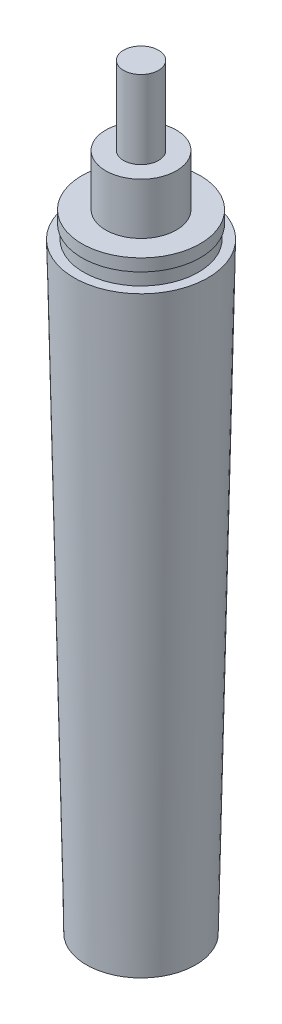
ISO-10303-21;
HEADER;
FILE_DESCRIPTION(('STEP AP214'),'2;1');
FILE_NAME('part.step','',(''),(''),'','','');
FILE_SCHEMA(('AUTOMOTIVE_DESIGN { 1 0 10303 214 1 1 1 1 }'));
ENDSEC;
DATA;
#1=APPLICATION_CONTEXT('core data for automotive mechanical design processes');
#2=APPLICATION_PROTOCOL_DEFINITION('international standard','automotive_design',2000,#1);
#3=PRODUCT_CONTEXT('',#1,'mechanical');
#4=PRODUCT('Part','Part','',(#3));
#5=PRODUCT_RELATED_PRODUCT_CATEGORY('part','',(#4));
#6=PRODUCT_DEFINITION_FORMATION('','',#4);
#7=PRODUCT_DEFINITION_CONTEXT('part definition',#1,'design');
#8=PRODUCT_DEFINITION('design','',#6,#7);
#9=PRODUCT_DEFINITION_SHAPE('','',#8);
#10=(LENGTH_UNIT() NAMED_UNIT(*) SI_UNIT(.MILLI.,.METRE.));
#11=(NAMED_UNIT(*) PLANE_ANGLE_UNIT() SI_UNIT($,.RADIAN.));
#12=(NAMED_UNIT(*) SI_UNIT($,.STERADIAN.) SOLID_ANGLE_UNIT());
#13=UNCERTAINTY_MEASURE_WITH_UNIT(LENGTH_MEASURE(1.E-05),#10,'distance_accuracy_value','');
#14=(GEOMETRIC_REPRESENTATION_CONTEXT(3) GLOBAL_UNCERTAINTY_ASSIGNED_CONTEXT((#13)) GLOBAL_UNIT_ASSIGNED_CONTEXT((#10,
#11,#12)) REPRESENTATION_CONTEXT('',''));
#15=CARTESIAN_POINT('',(0.,0.,0.));
#16=DIRECTION('',(0.,0.,1.));
#17=DIRECTION('',(1.,0.,0.));
#18=AXIS2_PLACEMENT_3D('',#15,#16,#17);
#19=CARTESIAN_POINT('',(0.,10.5,0.));
#20=DIRECTION('',(0.,-1.,0.));
#21=DIRECTION('',(0.,0.,-1.));
#22=AXIS2_PLACEMENT_3D('',#19,#20,#21);
#23=CYLINDRICAL_SURFACE('',#22,2.35);
#24=CARTESIAN_POINT('',(0.,10.5,0.));
#25=DIRECTION('',(0.,1.,0.));
#26=DIRECTION('',(0.,0.,1.));
#27=AXIS2_PLACEMENT_3D('',#24,#25,#26);
#28=CIRCLE('',#27,2.35);
#29=CARTESIAN_POINT('',(0.,10.5,-2.35));
#30=VERTEX_POINT('',#29);
#31=EDGE_CURVE('E43',#30,#30,#28,.T.);
#32=CARTESIAN_POINT('',(0.,0.,0.));
#33=DIRECTION('',(0.,1.,0.));
#34=DIRECTION('',(0.,0.,1.));
#35=AXIS2_PLACEMENT_3D('',#32,#33,#34);
#36=CIRCLE('',#35,2.35);
#37=CARTESIAN_POINT('',(0.,0.,-2.35));
#38=VERTEX_POINT('',#37);
#39=EDGE_CURVE('E39',#38,#38,#36,.T.);
#40=CARTESIAN_POINT('',(0.,10.5,-2.35));
#41=CARTESIAN_POINT('',(0.,10.390625,-2.35));
#42=CARTESIAN_POINT('',(0.,10.28125,-2.35));
#43=CARTESIAN_POINT('',(0.,10.0625,-2.35));
#44=CARTESIAN_POINT('',(0.,9.953125,-2.35));
#45=CARTESIAN_POINT('',(0.,9.734375,-2.35));
#46=CARTESIAN_POINT('',(0.,9.625,-2.35));
#47=CARTESIAN_POINT('',(0.,9.40625,-2.35));
#48=CARTESIAN_POINT('',(0.,9.296875,-2.35));
#49=CARTESIAN_POINT('',(0.,9.078125,-2.35));
#50=CARTESIAN_POINT('',(0.,8.96875,-2.35));
#51=CARTESIAN_POINT('',(0.,8.75,-2.35));
#52=CARTESIAN_POINT('',(0.,8.640625,-2.35));
#53=CARTESIAN_POINT('',(0.,8.421875,-2.35));
#54=CARTESIAN_POINT('',(0.,8.3125,-2.35));
#55=CARTESIAN_POINT('',(0.,8.09375,-2.35));
#56=CARTESIAN_POINT('',(0.,7.984375,-2.35));
#57=CARTESIAN_POINT('',(0.,7.765625,-2.35));
#58=CARTESIAN_POINT('',(0.,7.65625,-2.35));
#59=CARTESIAN_POINT('',(0.,7.4375,-2.35));
#60=CARTESIAN_POINT('',(0.,7.328125,-2.35));
#61=CARTESIAN_POINT('',(0.,7.109375,-2.35));
#62=CARTESIAN_POINT('',(0.,7.,-2.35));
#63=CARTESIAN_POINT('',(0.,6.78125,-2.35));
#64=CARTESIAN_POINT('',(0.,6.671875,-2.35));
#65=CARTESIAN_POINT('',(0.,6.453125,-2.35));
#66=CARTESIAN_POINT('',(0.,6.34375,-2.35));
#67=CARTESIAN_POINT('',(0.,6.125,-2.35));
#68=CARTESIAN_POINT('',(0.,6.015625,-2.35));
#69=CARTESIAN_POINT('',(0.,5.796875,-2.35));
#70=CARTESIAN_POINT('',(0.,5.6875,-2.35));
#71=CARTESIAN_POINT('',(0.,5.46875,-2.35));
#72=CARTESIAN_POINT('',(0.,5.359375,-2.35));
#73=CARTESIAN_POINT('',(0.,5.140625,-2.35));
#74=CARTESIAN_POINT('',(0.,5.03125,-2.35));
#75=CARTESIAN_POINT('',(0.,4.8125,-2.35));
#76=CARTESIAN_POINT('',(0.,4.703125,-2.35));
#77=CARTESIAN_POINT('',(0.,4.484375,-2.35));
#78=CARTESIAN_POINT('',(0.,4.375,-2.35));
#79=CARTESIAN_POINT('',(0.,4.15625,-2.35));
#80=CARTESIAN_POINT('',(0.,4.046875,-2.35));
#81=CARTESIAN_POINT('',(0.,3.828125,-2.35));
#82=CARTESIAN_POINT('',(0.,3.71875,-2.35));
#83=CARTESIAN_POINT('',(0.,3.5,-2.35));
#84=CARTESIAN_POINT('',(0.,3.390625,-2.35));
#85=CARTESIAN_POINT('',(0.,3.171875,-2.35));
#86=CARTESIAN_POINT('',(0.,3.0625,-2.35));
#87=CARTESIAN_POINT('',(0.,2.84375,-2.35));
#88=CARTESIAN_POINT('',(0.,2.734375,-2.35));
#89=CARTESIAN_POINT('',(0.,2.515625,-2.35));
#90=CARTESIAN_POINT('',(0.,2.40625,-2.35));
#91=CARTESIAN_POINT('',(0.,2.1875,-2.35));
#92=CARTESIAN_POINT('',(0.,2.078125,-2.35));
#93=CARTESIAN_POINT('',(0.,1.859375,-2.35));
#94=CARTESIAN_POINT('',(0.,1.75,-2.35));
#95=CARTESIAN_POINT('',(0.,1.53125,-2.35));
#96=CARTESIAN_POINT('',(0.,1.421875,-2.35));
#97=CARTESIAN_POINT('',(0.,1.203125,-2.35));
#98=CARTESIAN_POINT('',(0.,1.09375,-2.35));
#99=CARTESIAN_POINT('',(0.,0.875000000000001,-2.35));
#100=CARTESIAN_POINT('',(0.,0.765625000000001,-2.35));
#101=CARTESIAN_POINT('',(0.,0.546875,-2.35));
#102=CARTESIAN_POINT('',(0.,0.4375,-2.35));
#103=CARTESIAN_POINT('',(0.,0.21875,-2.35));
#104=CARTESIAN_POINT('',(0.,0.109375,-2.35));
#105=CARTESIAN_POINT('',(0.,0.,-2.35));
#106=B_SPLINE_CURVE_WITH_KNOTS('',3,(#40,#41,#42,#43,#44,#45,#46,#47,#48,#49,#50,#51,#52,#53,
#54,#55,#56,#57,#58,#59,#60,#61,#62,#63,#64,#65,#66,#67,#68,#69,#70,#71,#72,#73,#74,#75,#76,#77,
#78,#79,#80,#81,#82,#83,#84,#85,#86,#87,#88,#89,#90,#91,#92,#93,#94,#95,#96,#97,#98,#99,#100,
#101,#102,#103,#104,#105),.UNSPECIFIED.,.F.,.F.,(4,2,2,2,2,2,2,2,2,2,2,2,2,2,2,2,2,2,2,2,2,2,2,
2,2,2,2,2,2,2,2,2,4),(0.,0.328125,0.656250000000001,0.984375000000001,1.3125,1.640625,1.96875,
2.296875,2.625,2.953125,3.28125,3.609375,3.9375,4.265625,4.59375,4.921875,5.25,5.578125,5.90625,
6.234375,6.5625,6.890625,7.21875,7.546875,7.875,8.203125,8.53125,8.859375,9.1875,9.515625,
9.84375,10.171875,10.5),.UNSPECIFIED.);
#107=EDGE_CURVE('BSEAM36',#30,#38,#106,.T.);
#108=ORIENTED_EDGE('',*,*,#31,.F.);
#109=ORIENTED_EDGE('',*,*,#39,.T.);
#110=ORIENTED_EDGE('',*,*,#107,.T.);
#111=ORIENTED_EDGE('',*,*,#107,.F.);
#112=EDGE_LOOP('',(#108,#110,#109,#111));
#113=FACE_BOUND('',#112,.T.);
#114=ADVANCED_FACE('F36',(#113),#23,.T.);
#115=CARTESIAN_POINT('',(0.,10.5,0.));
#116=DIRECTION('',(0.,1.,0.));
#117=DIRECTION('',(0.,0.,1.));
#118=AXIS2_PLACEMENT_3D('',#115,#116,#117);
#119=PLANE('',#118);
#120=ORIENTED_EDGE('',*,*,#31,.T.);
#121=EDGE_LOOP('',(#120));
#122=FACE_BOUND('',#121,.T.);
#123=ADVANCED_FACE('F79',(#122),#119,.T.);
#124=CARTESIAN_POINT('',(0.,-6.9,0.));
#125=DIRECTION('',(0.,1.,0.));
#126=DIRECTION('',(0.,0.,1.));
#127=AXIS2_PLACEMENT_3D('',#124,#125,#126);
#128=CYLINDRICAL_SURFACE('',#127,4.75);
#129=CARTESIAN_POINT('',(0.,-6.9,0.));
#130=DIRECTION('',(0.,-1.,0.));
#131=DIRECTION('',(0.,0.,-1.));
#132=AXIS2_PLACEMENT_3D('',#129,#130,#131);
#133=CIRCLE('',#132,4.75);
#134=CARTESIAN_POINT('',(0.,-6.9,4.75));
#135=VERTEX_POINT('',#134);
#136=EDGE_CURVE('E59',#135,#135,#133,.T.);
#137=CARTESIAN_POINT('',(0.,0.,0.));
#138=DIRECTION('',(0.,-1.,0.));
#139=DIRECTION('',(0.,0.,-1.));
#140=AXIS2_PLACEMENT_3D('',#137,#138,#139);
#141=CIRCLE('',#140,4.75);
#142=CARTESIAN_POINT('',(0.,0.,4.75));
#143=VERTEX_POINT('',#142);
#144=EDGE_CURVE('E55',#143,#143,#141,.T.);
#145=CARTESIAN_POINT('',(0.,-6.9,4.75));
#146=CARTESIAN_POINT('',(0.,-6.828125,4.75));
#147=CARTESIAN_POINT('',(0.,-6.75625,4.75));
#148=CARTESIAN_POINT('',(0.,-6.6125,4.75));
#149=CARTESIAN_POINT('',(0.,-6.540625,4.75));
#150=CARTESIAN_POINT('',(0.,-6.396875,4.75));
#151=CARTESIAN_POINT('',(0.,-6.325,4.75));
#152=CARTESIAN_POINT('',(0.,-6.18125,4.75));
#153=CARTESIAN_POINT('',(0.,-6.109375,4.75));
#154=CARTESIAN_POINT('',(0.,-5.965625,4.75));
#155=CARTESIAN_POINT('',(0.,-5.89375,4.75));
#156=CARTESIAN_POINT('',(0.,-5.75,4.75));
#157=CARTESIAN_POINT('',(0.,-5.678125,4.75));
#158=CARTESIAN_POINT('',(0.,-5.534375,4.75));
#159=CARTESIAN_POINT('',(0.,-5.4625,4.75));
#160=CARTESIAN_POINT('',(0.,-5.31875,4.75));
#161=CARTESIAN_POINT('',(0.,-5.246875,4.75));
#162=CARTESIAN_POINT('',(0.,-5.103125,4.75));
#163=CARTESIAN_POINT('',(0.,-5.03125,4.75));
#164=CARTESIAN_POINT('',(0.,-4.8875,4.75));
#165=CARTESIAN_POINT('',(0.,-4.815625,4.75));
#166=CARTESIAN_POINT('',(0.,-4.671875,4.75));
#167=CARTESIAN_POINT('',(0.,-4.6,4.75));
#168=CARTESIAN_POINT('',(0.,-4.45625,4.75));
#169=CARTESIAN_POINT('',(0.,-4.384375,4.75));
#170=CARTESIAN_POINT('',(0.,-4.240625,4.75));
#171=CARTESIAN_POINT('',(0.,-4.16875,4.75));
#172=CARTESIAN_POINT('',(0.,-4.025,4.75));
#173=CARTESIAN_POINT('',(0.,-3.953125,4.75));
#174=CARTESIAN_POINT('',(0.,-3.809375,4.75));
#175=CARTESIAN_POINT('',(0.,-3.7375,4.75));
#176=CARTESIAN_POINT('',(0.,-3.59375,4.75));
#177=CARTESIAN_POINT('',(0.,-3.521875,4.75));
#178=CARTESIAN_POINT('',(0.,-3.378125,4.75));
#179=CARTESIAN_POINT('',(0.,-3.30625,4.75));
#180=CARTESIAN_POINT('',(0.,-3.1625,4.75));
#181=CARTESIAN_POINT('',(0.,-3.090625,4.75));
#182=CARTESIAN_POINT('',(0.,-2.946875,4.75));
#183=CARTESIAN_POINT('',(0.,-2.875,4.75));
#184=CARTESIAN_POINT('',(0.,-2.73125,4.75));
#185=CARTESIAN_POINT('',(0.,-2.659375,4.75));
#186=CARTESIAN_POINT('',(0.,-2.515625,4.75));
#187=CARTESIAN_POINT('',(0.,-2.44375,4.75));
#188=CARTESIAN_POINT('',(0.,-2.3,4.75));
#189=CARTESIAN_POINT('',(0.,-2.228125,4.75));
#190=CARTESIAN_POINT('',(0.,-2.084375,4.75));
#191=CARTESIAN_POINT('',(0.,-2.0125,4.75));
#192=CARTESIAN_POINT('',(0.,-1.86875,4.75));
#193=CARTESIAN_POINT('',(0.,-1.796875,4.75));
#194=CARTESIAN_POINT('',(0.,-1.653125,4.75));
#195=CARTESIAN_POINT('',(0.,-1.58125,4.75));
#196=CARTESIAN_POINT('',(0.,-1.4375,4.75));
#197=CARTESIAN_POINT('',(0.,-1.365625,4.75));
#198=CARTESIAN_POINT('',(0.,-1.221875,4.75));
#199=CARTESIAN_POINT('',(0.,-1.15,4.75));
#200=CARTESIAN_POINT('',(0.,-1.00625,4.75));
#201=CARTESIAN_POINT('',(0.,-0.934375,4.75));
#202=CARTESIAN_POINT('',(0.,-0.790625,4.75));
#203=CARTESIAN_POINT('',(0.,-0.71875,4.75));
#204=CARTESIAN_POINT('',(0.,-0.575,4.75));
#205=CARTESIAN_POINT('',(0.,-0.503125,4.75));
#206=CARTESIAN_POINT('',(0.,-0.359375,4.75));
#207=CARTESIAN_POINT('',(0.,-0.2875,4.75));
#208=CARTESIAN_POINT('',(0.,-0.14375,4.75));
#209=CARTESIAN_POINT('',(0.,-0.0718749999999998,4.75));
#210=CARTESIAN_POINT('',(0.,0.,4.75));
#211=B_SPLINE_CURVE_WITH_KNOTS('',3,(#145,#146,#147,#148,#149,#150,#151,#152,#153,#154,#155,
#156,#157,#158,#159,#160,#161,#162,#163,#164,#165,#166,#167,#168,#169,#170,#171,#172,#173,#174,
#175,#176,#177,#178,#179,#180,#181,#182,#183,#184,#185,#186,#187,#188,#189,#190,#191,#192,#193,
#194,#195,#196,#197,#198,#199,#200,#201,#202,#203,#204,#205,#206,#207,#208,#209,#210),
.UNSPECIFIED.,.F.,.F.,(4,2,2,2,2,2,2,2,2,2,2,2,2,2,2,2,2,2,2,2,2,2,2,2,2,2,2,2,2,2,2,2,4),(0.,
0.215625000000001,0.43125,0.646875000000001,0.8625,1.078125,1.29375,1.509375,1.725,1.940625,
2.15625,2.371875,2.5875,2.803125,3.01875,3.234375,3.45,3.665625,3.88125,4.096875,4.3125,
4.528125,4.74375,4.959375,5.175,5.390625,5.60625,5.821875,6.0375,6.253125,6.46875,6.684375,6.9),.UNSPECIFIED.);
#212=EDGE_CURVE('BSEAM65',#135,#143,#211,.T.);
#213=ORIENTED_EDGE('',*,*,#136,.F.);
#214=ORIENTED_EDGE('',*,*,#144,.T.);
#215=ORIENTED_EDGE('',*,*,#212,.T.);
#216=ORIENTED_EDGE('',*,*,#212,.F.);
#217=EDGE_LOOP('',(#213,#215,#214,#216));
#218=FACE_BOUND('',#217,.T.);
#219=ADVANCED_FACE('F65',(#218),#128,.T.);
#220=CARTESIAN_POINT('',(0.,0.,0.));
#221=DIRECTION('',(0.,-1.,0.));
#222=DIRECTION('',(0.,0.,-1.));
#223=AXIS2_PLACEMENT_3D('',#220,#221,#222);
#224=PLANE('',#223);
#225=ORIENTED_EDGE('',*,*,#39,.F.);
#226=EDGE_LOOP('',(#225));
#227=FACE_BOUND('',#226,.T.);
#228=ORIENTED_EDGE('',*,*,#144,.F.);
#229=EDGE_LOOP('',(#228));
#230=FACE_BOUND('',#229,.T.);
#231=ADVANCED_FACE('F67',(#227,#230),#224,.F.);
#232=CARTESIAN_POINT('',(0.,-8.54,0.));
#233=DIRECTION('',(0.,1.,0.));
#234=DIRECTION('',(0.,0.,1.));
#235=AXIS2_PLACEMENT_3D('',#232,#233,#234);
#236=CYLINDRICAL_SURFACE('',#235,7.95);
#237=CARTESIAN_POINT('',(0.,-8.54,0.));
#238=DIRECTION('',(0.,-1.,0.));
#239=DIRECTION('',(0.,0.,-1.));
#240=AXIS2_PLACEMENT_3D('',#237,#238,#239);
#241=CIRCLE('',#240,7.95);
#242=CARTESIAN_POINT('',(0.,-8.54,-7.95));
#243=VERTEX_POINT('',#242);
#244=EDGE_CURVE('E52',#243,#243,#241,.T.);
#245=ORIENTED_EDGE('',*,*,#244,.F.);
#246=EDGE_LOOP('',(#245));
#247=FACE_BOUND('',#246,.T.);
#248=CARTESIAN_POINT('',(0.,-6.9,0.));
#249=DIRECTION('',(0.,-1.,0.));
#250=DIRECTION('',(0.,0.,-1.));
#251=AXIS2_PLACEMENT_3D('',#248,#249,#250);
#252=CIRCLE('',#251,7.95);
#253=CARTESIAN_POINT('',(0.,-6.9,-7.95));
#254=VERTEX_POINT('',#253);
#255=EDGE_CURVE('E56',#254,#254,#252,.T.);
#256=ORIENTED_EDGE('',*,*,#255,.T.);
#257=EDGE_LOOP('',(#256));
#258=FACE_BOUND('',#257,.T.);
#259=ADVANCED_FACE('F69',(#247,#258),#236,.T.);
#260=CARTESIAN_POINT('',(0.,-8.54,0.));
#261=DIRECTION('',(0.,-1.,0.));
#262=DIRECTION('',(0.,0.,-1.));
#263=AXIS2_PLACEMENT_3D('',#260,#261,#262);
#264=PLANE('',#263);
#265=CARTESIAN_POINT('',(0.,-8.54,0.));
#266=DIRECTION('',(0.,-1.,0.));
#267=DIRECTION('',(0.,0.,-1.));
#268=AXIS2_PLACEMENT_3D('',#265,#266,#267);
#269=CIRCLE('',#268,7.715);
#270=CARTESIAN_POINT('',(0.,-8.54,-7.715));
#271=VERTEX_POINT('',#270);
#272=EDGE_CURVE('E11',#271,#271,#269,.T.);
#273=ORIENTED_EDGE('',*,*,#272,.F.);
#274=EDGE_LOOP('',(#273));
#275=FACE_BOUND('',#274,.T.);
#276=ORIENTED_EDGE('',*,*,#244,.T.);
#277=EDGE_LOOP('',(#276));
#278=FACE_BOUND('',#277,.T.);
#279=ADVANCED_FACE('F76',(#275,#278),#264,.T.);
#280=CARTESIAN_POINT('',(0.,-6.9,0.));
#281=DIRECTION('',(0.,-1.,0.));
#282=DIRECTION('',(0.,0.,-1.));
#283=AXIS2_PLACEMENT_3D('',#280,#281,#282);
#284=PLANE('',#283);
#285=ORIENTED_EDGE('',*,*,#136,.T.);
#286=EDGE_LOOP('',(#285));
#287=FACE_BOUND('',#286,.T.);
#288=ORIENTED_EDGE('',*,*,#255,.F.);
#289=EDGE_LOOP('',(#288));
#290=FACE_BOUND('',#289,.T.);
#291=ADVANCED_FACE('F115',(#287,#290),#284,.F.);
#292=CARTESIAN_POINT('',(0.,-10.34,0.));
#293=DIRECTION('',(0.,1.,0.));
#294=DIRECTION('',(0.,0.,1.));
#295=AXIS2_PLACEMENT_3D('',#292,#293,#294);
#296=CYLINDRICAL_SURFACE('',#295,7.715);
#297=CARTESIAN_POINT('',(0.,-10.34,0.));
#298=DIRECTION('',(0.,-1.,0.));
#299=DIRECTION('',(0.,0.,-1.));
#300=AXIS2_PLACEMENT_3D('',#297,#298,#299);
#301=CIRCLE('',#300,7.715);
#302=CARTESIAN_POINT('',(0.,-10.34,-7.715));
#303=VERTEX_POINT('',#302);
#304=EDGE_CURVE('E50',#303,#303,#301,.T.);
#305=ORIENTED_EDGE('',*,*,#304,.F.);
#306=EDGE_LOOP('',(#305));
#307=FACE_BOUND('',#306,.T.);
#308=ORIENTED_EDGE('',*,*,#272,.T.);
#309=EDGE_LOOP('',(#308));
#310=FACE_BOUND('',#309,.T.);
#311=ADVANCED_FACE('F120',(#307,#310),#296,.T.);
#312=CARTESIAN_POINT('',(0.,-91.19,0.));
#313=DIRECTION('',(0.,-1.,0.));
#314=DIRECTION('',(0.,0.,-1.));
#315=AXIS2_PLACEMENT_3D('',#312,#313,#314);
#316=PLANE('',#315);
#317=CARTESIAN_POINT('',(0.,-91.19,0.));
#318=DIRECTION('',(0.,-1.,0.));
#319=DIRECTION('',(0.,0.,-1.));
#320=AXIS2_PLACEMENT_3D('',#317,#318,#319);
#321=CIRCLE('',#320,7.35);
#322=CARTESIAN_POINT('',(0.,-91.19,-7.35));
#323=VERTEX_POINT('',#322);
#324=EDGE_CURVE('E188',#323,#323,#321,.T.);
#325=ORIENTED_EDGE('',*,*,#324,.T.);
#326=EDGE_LOOP('',(#325));
#327=FACE_BOUND('',#326,.T.);
#328=ADVANCED_FACE('F137',(#327),#316,.T.);
#329=CARTESIAN_POINT('',(0.,-10.34,0.));
#330=DIRECTION('',(0.,-1.,0.));
#331=DIRECTION('',(0.,0.,-1.));
#332=AXIS2_PLACEMENT_3D('',#329,#330,#331);
#333=PLANE('',#332);
#334=ORIENTED_EDGE('',*,*,#304,.T.);
#335=EDGE_LOOP('',(#334));
#336=FACE_BOUND('',#335,.T.);
#337=CARTESIAN_POINT('',(0.,-10.34,0.));
#338=DIRECTION('',(0.,-1.,0.));
#339=DIRECTION('',(0.,0.,-1.));
#340=AXIS2_PLACEMENT_3D('',#337,#338,#339);
#341=CIRCLE('',#340,9.);
#342=CARTESIAN_POINT('',(0.,-10.34,-9.));
#343=VERTEX_POINT('',#342);
#344=EDGE_CURVE('E181',#343,#343,#341,.T.);
#345=ORIENTED_EDGE('',*,*,#344,.F.);
#346=EDGE_LOOP('',(#345));
#347=FACE_BOUND('',#346,.T.);
#348=ADVANCED_FACE('F147',(#336,#347),#333,.F.);
#349=CARTESIAN_POINT('',(0.,-91.19,0.));
#350=DIRECTION('',(0.,1.,0.));
#351=DIRECTION('',(0.,0.,1.));
#352=AXIS2_PLACEMENT_3D('',#349,#350,#351);
#353=CONICAL_SURFACE('',#352,7.35,0.0204053306865381);
#354=ORIENTED_EDGE('',*,*,#344,.T.);
#355=EDGE_LOOP('',(#354));
#356=FACE_BOUND('',#355,.T.);
#357=ORIENTED_EDGE('',*,*,#324,.F.);
#358=EDGE_LOOP('',(#357));
#359=FACE_BOUND('',#358,.T.);
#360=ADVANCED_FACE('F157',(#356,#359),#353,.T.);
#361=CLOSED_SHELL('',(#114,#123,#219,#231,#259,#279,#291,#311,#328,#348,#360));
#362=MANIFOLD_SOLID_BREP('B2',#361);
#363=ADVANCED_BREP_SHAPE_REPRESENTATION('',(#18,#362),#14);
#364=SHAPE_DEFINITION_REPRESENTATION(#9,#363);
ENDSEC;
END-ISO-10303-21;
